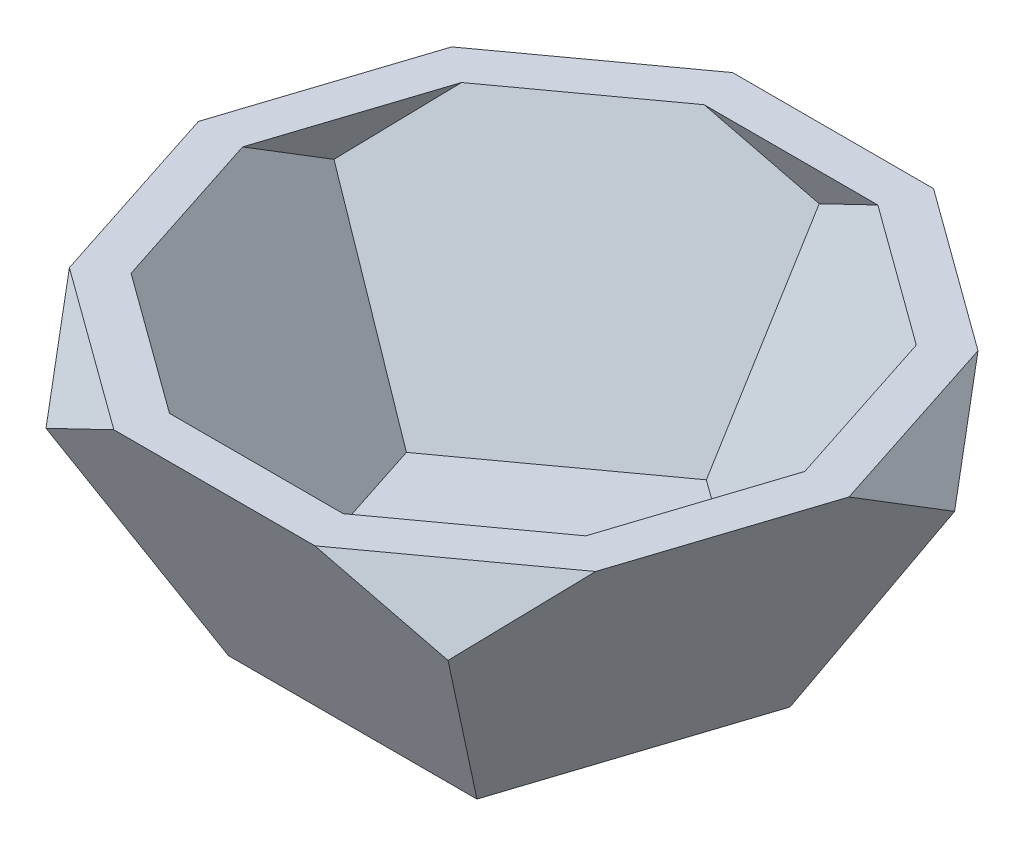
ISO-10303-21;
HEADER;
FILE_DESCRIPTION(('STEP AP214'),'2;1');
FILE_NAME('part.step','',(''),(''),'','','');
FILE_SCHEMA(('AUTOMOTIVE_DESIGN { 1 0 10303 214 1 1 1 1 }'));
ENDSEC;
DATA;
#1=APPLICATION_CONTEXT('core data for automotive mechanical design processes');
#2=APPLICATION_PROTOCOL_DEFINITION('international standard','automotive_design',2000,#1);
#3=PRODUCT_CONTEXT('',#1,'mechanical');
#4=PRODUCT('Part','Part','',(#3));
#5=PRODUCT_RELATED_PRODUCT_CATEGORY('part','',(#4));
#6=PRODUCT_DEFINITION_FORMATION('','',#4);
#7=PRODUCT_DEFINITION_CONTEXT('part definition',#1,'design');
#8=PRODUCT_DEFINITION('design','',#6,#7);
#9=PRODUCT_DEFINITION_SHAPE('','',#8);
#10=(LENGTH_UNIT() NAMED_UNIT(*) SI_UNIT(.MILLI.,.METRE.));
#11=(NAMED_UNIT(*) PLANE_ANGLE_UNIT() SI_UNIT($,.RADIAN.));
#12=(NAMED_UNIT(*) SI_UNIT($,.STERADIAN.) SOLID_ANGLE_UNIT());
#13=UNCERTAINTY_MEASURE_WITH_UNIT(LENGTH_MEASURE(1.E-05),#10,'distance_accuracy_value','');
#14=(GEOMETRIC_REPRESENTATION_CONTEXT(3) GLOBAL_UNCERTAINTY_ASSIGNED_CONTEXT((#13)) GLOBAL_UNIT_ASSIGNED_CONTEXT((#10,
#11,#12)) REPRESENTATION_CONTEXT('',''));
#15=CARTESIAN_POINT('',(0.,0.,0.));
#16=DIRECTION('',(0.,0.,1.));
#17=DIRECTION('',(1.,0.,0.));
#18=AXIS2_PLACEMENT_3D('',#15,#16,#17);
#19=CARTESIAN_POINT('',(8.39798179212871,0.,11.558830307132));
#20=DIRECTION('',(0.850650808330349,-0.447213595545573,0.276393202242972));
#21=DIRECTION('',(0.465341127241469,0.88513142261341,0.));
#22=AXIS2_PLACEMENT_3D('',#19,#20,#21);
#23=PLANE('',#22);
#24=DIRECTION('',(-0.309016994374947,0.,0.951056516295154));
#25=VECTOR('',#24,1.);
#26=CARTESIAN_POINT('',(17.2914717679257,18.7023375,14.4485003685184));
#27=LINE('',#26,#25);
#28=CARTESIAN_POINT('',(17.787107601604,18.7023375,12.9230901227727));
#29=VERTEX_POINT('',#28);
#30=CARTESIAN_POINT('',(21.9860741186857,18.7023375,0.));
#31=VERTEX_POINT('',#30);
#32=EDGE_CURVE('E311',#29,#31,#27,.F.);
#33=ORIENTED_EDGE('',*,*,#32,.F.);
#34=DIRECTION('',(0.50000000001762,0.525731112070631,-0.688190960259838));
#35=VECTOR('',#34,1.);
#36=CARTESIAN_POINT('',(10.9930614391002,11.5586546113071,22.2742924276894));
#37=LINE('',#36,#35);
#38=CARTESIAN_POINT('',(13.5881410845222,14.2872828270101,18.7024717215479));
#39=VERTEX_POINT('',#38);
#40=EDGE_CURVE('E349',#39,#29,#37,.T.);
#41=ORIENTED_EDGE('',*,*,#40,.F.);
#42=DIRECTION('',(-0.309016994403458,-0.850650808322063,-0.42532540421526));
#43=VECTOR('',#42,1.);
#44=CARTESIAN_POINT('',(8.39798179212871,0.,11.558830307132));
#45=LINE('',#44,#43);
#46=CARTESIAN_POINT('',(8.39798179212871,0.,11.558830307132));
#47=VERTEX_POINT('',#46);
#48=EDGE_CURVE('E380',#39,#47,#45,.T.);
#49=ORIENTED_EDGE('',*,*,#48,.T.);
#50=DIRECTION('',(0.309016994374947,0.,-0.951056516295154));
#51=VECTOR('',#50,1.);
#52=CARTESIAN_POINT('',(8.39798179212871,0.,11.558830307132));
#53=LINE('',#52,#51);
#54=CARTESIAN_POINT('',(13.588219976567,0.,-4.41508030713206));
#55=VERTEX_POINT('',#54);
#56=EDGE_CURVE('E360',#47,#55,#53,.T.);
#57=ORIENTED_EDGE('',*,*,#56,.T.);
#58=DIRECTION('',(-0.50000000004613,-0.850650808322063,0.162459848131442));
#59=VECTOR('',#58,1.);
#60=CARTESIAN_POINT('',(13.588219976567,0.,-4.41508030713206));
#61=LINE('',#60,#59);
#62=CARTESIAN_POINT('',(21.9860741186857,14.2872828270101,-7.14370852399755));
#63=VERTEX_POINT('',#62);
#64=EDGE_CURVE('E51',#63,#55,#61,.T.);
#65=ORIENTED_EDGE('',*,*,#64,.F.);
#66=DIRECTION('',(0.,-0.525731112070629,-0.850650808382017));
#67=VECTOR('',#66,1.);
#68=CARTESIAN_POINT('',(21.9860741186857,18.7024046108998,0.000108587716949075));
#69=LINE('',#68,#67);
#70=EDGE_CURVE('E357',#31,#63,#69,.T.);
#71=ORIENTED_EDGE('',*,*,#70,.F.);
#72=EDGE_LOOP('',(#33,#41,#49,#57,#65,#71));
#73=FACE_BOUND('',#72,.T.);
#74=ADVANCED_FACE('F42',(#73),#23,.T.);
#75=CARTESIAN_POINT('',(13.588219976567,0.,-4.41508030713206));
#76=DIRECTION('',(0.525731112105727,-0.447213595545573,-0.723606797731527));
#77=DIRECTION('',(-0.809016994374948,0.,-0.587785252292473));
#78=AXIS2_PLACEMENT_3D('',#75,#76,#77);
#79=PLANE('',#78);
#80=DIRECTION('',(0.809016994374948,0.,0.587785252292473));
#81=VECTOR('',#80,1.);
#82=CARTESIAN_POINT('',(19.084699060216,18.7023375,-11.9803347441146));
#83=LINE('',#82,#81);
#84=CARTESIAN_POINT('',(17.787107601604,18.7023375,-12.9230901227727));
#85=VERTEX_POINT('',#84);
#86=CARTESIAN_POINT('',(6.79407054226109,18.7023375,-20.9099990583243));
#87=VERTEX_POINT('',#86);
#88=EDGE_CURVE('E66',#85,#87,#83,.F.);
#89=ORIENTED_EDGE('',*,*,#88,.F.);
#90=DIRECTION('',(-0.50000000001762,0.525731112070631,-0.688190960259838));
#91=VECTOR('',#90,1.);
#92=CARTESIAN_POINT('',(24.5811537641077,11.5586546113072,-3.57188781785601));
#93=LINE('',#92,#91);
#94=EDGE_CURVE('E353',#63,#85,#93,.T.);
#95=ORIENTED_EDGE('',*,*,#94,.F.);
#96=ORIENTED_EDGE('',*,*,#64,.T.);
#97=DIRECTION('',(-0.809016994374948,0.,-0.587785252292473));
#98=VECTOR('',#97,1.);
#99=CARTESIAN_POINT('',(13.588219976567,0.,-4.41508030713206));
#100=LINE('',#99,#98);
#101=CARTESIAN_POINT('',(0.,0.,-14.2875));
#102=VERTEX_POINT('',#101);
#103=EDGE_CURVE('E364',#55,#102,#100,.T.);
#104=ORIENTED_EDGE('',*,*,#103,.T.);
#105=DIRECTION('',(0.,-0.850650808322063,0.525731112167637));
#106=VECTOR('',#105,1.);
#107=CARTESIAN_POINT('',(0.,0.,-14.2875));
#108=LINE('',#107,#106);
#109=CARTESIAN_POINT('',(0.,14.2872828270101,-23.1175263951007));
#110=VERTEX_POINT('',#109);
#111=EDGE_CURVE('E383',#110,#102,#108,.T.);
#112=ORIENTED_EDGE('',*,*,#111,.F.);
#113=DIRECTION('',(-0.809016994403457,-0.52573111207063,-0.26286555606883));
#114=VECTOR('',#113,1.);
#115=CARTESIAN_POINT('',(6.79417381531687,18.7024046108998,-20.9099655028744));
#116=LINE('',#115,#114);
#117=EDGE_CURVE('E329',#87,#110,#116,.T.);
#118=ORIENTED_EDGE('',*,*,#117,.F.);
#119=EDGE_LOOP('',(#89,#95,#96,#104,#112,#118));
#120=FACE_BOUND('',#119,.T.);
#121=ADVANCED_FACE('F44',(#120),#79,.T.);
#122=CARTESIAN_POINT('',(0.,0.,-14.2875));
#123=DIRECTION('',(-0.525731112105728,-0.447213595545573,-0.723606797731527));
#124=DIRECTION('',(-0.809016994374947,0.,0.587785252292474));
#125=AXIS2_PLACEMENT_3D('',#122,#123,#124);
#126=PLANE('',#125);
#127=DIRECTION('',(0.809016994374947,0.,-0.587785252292474));
#128=VECTOR('',#127,1.);
#129=CARTESIAN_POINT('',(-5.49647908364905,18.7023375,-21.8527544369825));
#130=LINE('',#129,#128);
#131=CARTESIAN_POINT('',(-6.7940705422611,18.7023375,-20.9099990583243));
#132=VERTEX_POINT('',#131);
#133=CARTESIAN_POINT('',(-17.787107601604,18.7023375,-12.9230901227727));
#134=VERTEX_POINT('',#133);
#135=EDGE_CURVE('E279',#132,#134,#130,.F.);
#136=ORIENTED_EDGE('',*,*,#135,.F.);
#137=DIRECTION('',(-0.809016994403457,0.52573111207063,0.26286555606883));
#138=VECTOR('',#137,1.);
#139=CARTESIAN_POINT('',(4.19892706980575,11.5586546113072,-24.4818405031261));
#140=LINE('',#139,#138);
#141=EDGE_CURVE('E325',#110,#132,#140,.T.);
#142=ORIENTED_EDGE('',*,*,#141,.F.);
#143=ORIENTED_EDGE('',*,*,#111,.T.);
#144=DIRECTION('',(-0.809016994374947,0.,0.587785252292474));
#145=VECTOR('',#144,1.);
#146=CARTESIAN_POINT('',(0.,0.,-14.2875));
#147=LINE('',#146,#145);
#148=CARTESIAN_POINT('',(-13.588219976567,0.,-4.41508030713204));
#149=VERTEX_POINT('',#148);
#150=EDGE_CURVE('E368',#102,#149,#147,.T.);
#151=ORIENTED_EDGE('',*,*,#150,.T.);
#152=DIRECTION('',(0.50000000004613,-0.850650808322063,0.162459848131441));
#153=VECTOR('',#152,1.);
#154=CARTESIAN_POINT('',(-13.588219976567,0.,-4.41508030713204));
#155=LINE('',#154,#153);
#156=CARTESIAN_POINT('',(-21.9860741186858,14.2872828270101,-7.14370852399752));
#157=VERTEX_POINT('',#156);
#158=EDGE_CURVE('E389',#157,#149,#155,.T.);
#159=ORIENTED_EDGE('',*,*,#158,.F.);
#160=DIRECTION('',(-0.50000000001762,-0.52573111207063,0.688190960259839));
#161=VECTOR('',#160,1.);
#162=CARTESIAN_POINT('',(-17.7870437753454,18.7024046108998,-12.9231779720811));
#163=LINE('',#162,#161);
#164=EDGE_CURVE('E336',#134,#157,#163,.T.);
#165=ORIENTED_EDGE('',*,*,#164,.F.);
#166=EDGE_LOOP('',(#136,#142,#143,#151,#159,#165));
#167=FACE_BOUND('',#166,.T.);
#168=ADVANCED_FACE('F396',(#167),#126,.T.);
#169=CARTESIAN_POINT('',(-13.588219976567,0.,-4.41508030713204));
#170=DIRECTION('',(-0.850650808330348,-0.447213595545573,0.276393202242974));
#171=DIRECTION('',(0.46534112724147,-0.88513142261341,0.));
#172=AXIS2_PLACEMENT_3D('',#169,#170,#171);
#173=PLANE('',#172);
#174=DIRECTION('',(-0.309016994374949,0.,-0.951056516295153));
#175=VECTOR('',#174,1.);
#176=CARTESIAN_POINT('',(-22.481709952364,18.7023375,-1.52541024574567));
#177=LINE('',#176,#175);
#178=CARTESIAN_POINT('',(-21.9860741186858,18.7023375,0.));
#179=VERTEX_POINT('',#178);
#180=CARTESIAN_POINT('',(-17.787107601604,18.7023375,12.9230901227727));
#181=VERTEX_POINT('',#180);
#182=EDGE_CURVE('E308',#179,#181,#177,.F.);
#183=ORIENTED_EDGE('',*,*,#182,.F.);
#184=DIRECTION('',(0.,0.525731112070631,0.850650808382016));
#185=VECTOR('',#184,1.);
#186=CARTESIAN_POINT('',(-21.9860741186858,11.5586546113071,-11.5587217202298));
#187=LINE('',#186,#185);
#188=EDGE_CURVE('E332',#157,#179,#187,.T.);
#189=ORIENTED_EDGE('',*,*,#188,.F.);
#190=ORIENTED_EDGE('',*,*,#158,.T.);
#191=DIRECTION('',(0.309016994374949,0.,0.951056516295153));
#192=VECTOR('',#191,1.);
#193=CARTESIAN_POINT('',(-13.588219976567,0.,-4.41508030713204));
#194=LINE('',#193,#192);
#195=CARTESIAN_POINT('',(-8.39798179212869,0.,11.5588303071321));
#196=VERTEX_POINT('',#195);
#197=EDGE_CURVE('E372',#149,#196,#194,.T.);
#198=ORIENTED_EDGE('',*,*,#197,.T.);
#199=DIRECTION('',(0.309016994403457,-0.850650808322063,-0.425325404215261));
#200=VECTOR('',#199,1.);
#201=CARTESIAN_POINT('',(-8.39798179212869,0.,11.5588303071321));
#202=LINE('',#201,#200);
#203=CARTESIAN_POINT('',(-13.5881410845222,14.2872828270101,18.7024717215479));
#204=VERTEX_POINT('',#203);
#205=EDGE_CURVE('E386',#204,#196,#202,.T.);
#206=ORIENTED_EDGE('',*,*,#205,.F.);
#207=DIRECTION('',(0.500000000017621,-0.525731112070629,0.688190960259839));
#208=VECTOR('',#207,1.);
#209=CARTESIAN_POINT('',(-17.7871714278626,18.7024046108998,12.9230022734643));
#210=LINE('',#209,#208);
#211=EDGE_CURVE('E343',#181,#204,#210,.T.);
#212=ORIENTED_EDGE('',*,*,#211,.F.);
#213=EDGE_LOOP('',(#183,#189,#190,#198,#206,#212));
#214=FACE_BOUND('',#213,.T.);
#215=ADVANCED_FACE('F412',(#214),#173,.T.);
#216=CARTESIAN_POINT('',(-8.39798179212869,0.,11.5588303071321));
#217=DIRECTION('',(0.,-0.447213595545573,0.894427190977108));
#218=DIRECTION('',(0.,-0.894427190977108,-0.447213595545573));
#219=AXIS2_PLACEMENT_3D('',#216,#217,#218);
#220=PLANE('',#219);
#221=DIRECTION('',(-1.,0.,0.));
#222=VECTOR('',#221,1.);
#223=CARTESIAN_POINT('',(-8.39798179212868,18.7023375,20.9099990583243));
#224=LINE('',#223,#222);
#225=CARTESIAN_POINT('',(-6.79407054226109,18.7023375,20.9099990583243));
#226=VERTEX_POINT('',#225);
#227=CARTESIAN_POINT('',(6.79407054226109,18.7023375,20.9099990583243));
#228=VERTEX_POINT('',#227);
#229=EDGE_CURVE('E322',#226,#228,#224,.F.);
#230=ORIENTED_EDGE('',*,*,#229,.F.);
#231=DIRECTION('',(0.809016994403457,0.525731112070631,0.26286555606883));
#232=VECTOR('',#231,1.);
#233=CARTESIAN_POINT('',(-17.7870681543279,11.5586546113072,17.3381576135225));
#234=LINE('',#233,#232);
#235=EDGE_CURVE('E339',#204,#226,#234,.T.);
#236=ORIENTED_EDGE('',*,*,#235,.F.);
#237=ORIENTED_EDGE('',*,*,#205,.T.);
#238=DIRECTION('',(1.,0.,0.));
#239=VECTOR('',#238,1.);
#240=CARTESIAN_POINT('',(-8.39798179212869,0.,11.5588303071321));
#241=LINE('',#240,#239);
#242=EDGE_CURVE('E376',#196,#47,#241,.T.);
#243=ORIENTED_EDGE('',*,*,#242,.T.);
#244=ORIENTED_EDGE('',*,*,#48,.F.);
#245=DIRECTION('',(0.809016994403458,-0.525731112070629,-0.26286555606883));
#246=VECTOR('',#245,1.);
#247=CARTESIAN_POINT('',(6.7939672692053,18.7024046108998,20.9100326137742));
#248=LINE('',#247,#246);
#249=EDGE_CURVE('E346',#228,#39,#248,.T.);
#250=ORIENTED_EDGE('',*,*,#249,.F.);
#251=EDGE_LOOP('',(#230,#236,#237,#243,#244,#250));
#252=FACE_BOUND('',#251,.T.);
#253=ADVANCED_FACE('F424',(#252),#220,.T.);
#254=CARTESIAN_POINT('',(13.588219976567,37.404675,4.41508030713206));
#255=DIRECTION('',(-0.850650808330349,-0.447213595545573,0.276393202242973));
#256=DIRECTION('',(0.465341127241469,-0.88513142261341,0.));
#257=AXIS2_PLACEMENT_3D('',#254,#255,#256);
#258=PLANE('',#257);
#259=ORIENTED_EDGE('',*,*,#94,.T.);
#260=DIRECTION('',(-0.309016994374947,0.,-0.951056516295154));
#261=VECTOR('',#260,1.);
#262=CARTESIAN_POINT('',(22.481709952364,18.7023375,1.5254102457457));
#263=LINE('',#262,#261);
#264=EDGE_CURVE('E304',#85,#31,#263,.F.);
#265=ORIENTED_EDGE('',*,*,#264,.T.);
#266=ORIENTED_EDGE('',*,*,#70,.T.);
#267=EDGE_LOOP('',(#259,#265,#266));
#268=FACE_BOUND('',#267,.T.);
#269=ADVANCED_FACE('F434',(#268),#258,.F.);
#270=CARTESIAN_POINT('',(0.,37.404675,14.2875));
#271=DIRECTION('',(-0.525731112105727,-0.447213595545573,-0.723606797731527));
#272=DIRECTION('',(-0.809016994374948,0.,0.587785252292473));
#273=AXIS2_PLACEMENT_3D('',#270,#271,#272);
#274=PLANE('',#273);
#275=ORIENTED_EDGE('',*,*,#40,.T.);
#276=DIRECTION('',(0.809016994374948,0.,-0.587785252292473));
#277=VECTOR('',#276,1.);
#278=CARTESIAN_POINT('',(5.49647908364902,18.7023375,21.8527544369825));
#279=LINE('',#278,#277);
#280=EDGE_CURVE('E318',#29,#228,#279,.F.);
#281=ORIENTED_EDGE('',*,*,#280,.T.);
#282=ORIENTED_EDGE('',*,*,#249,.T.);
#283=EDGE_LOOP('',(#275,#281,#282));
#284=FACE_BOUND('',#283,.T.);
#285=ADVANCED_FACE('F429',(#284),#274,.F.);
#286=CARTESIAN_POINT('',(-13.588219976567,37.404675,4.41508030713206));
#287=DIRECTION('',(0.525731112105727,-0.447213595545573,-0.723606797731527));
#288=DIRECTION('',(-0.809016994374947,0.,-0.587785252292473));
#289=AXIS2_PLACEMENT_3D('',#286,#287,#288);
#290=PLANE('',#289);
#291=ORIENTED_EDGE('',*,*,#235,.T.);
#292=DIRECTION('',(0.809016994374947,0.,0.587785252292473));
#293=VECTOR('',#292,1.);
#294=CARTESIAN_POINT('',(-19.084699060216,18.7023375,11.9803347441146));
#295=LINE('',#294,#293);
#296=EDGE_CURVE('E314',#226,#181,#295,.F.);
#297=ORIENTED_EDGE('',*,*,#296,.T.);
#298=ORIENTED_EDGE('',*,*,#211,.T.);
#299=EDGE_LOOP('',(#291,#297,#298));
#300=FACE_BOUND('',#299,.T.);
#301=ADVANCED_FACE('F421',(#300),#290,.F.);
#302=CARTESIAN_POINT('',(-8.3979817921287,37.404675,-11.558830307132));
#303=DIRECTION('',(0.850650808330348,-0.447213595545573,0.276393202242973));
#304=DIRECTION('',(0.465341127241469,0.88513142261341,0.));
#305=AXIS2_PLACEMENT_3D('',#302,#303,#304);
#306=PLANE('',#305);
#307=ORIENTED_EDGE('',*,*,#188,.T.);
#308=DIRECTION('',(-0.309016994374947,0.,0.951056516295154));
#309=VECTOR('',#308,1.);
#310=CARTESIAN_POINT('',(-17.2914717679257,18.7023375,-14.4485003685184));
#311=LINE('',#310,#309);
#312=EDGE_CURVE('E300',#179,#134,#311,.F.);
#313=ORIENTED_EDGE('',*,*,#312,.T.);
#314=ORIENTED_EDGE('',*,*,#164,.T.);
#315=EDGE_LOOP('',(#307,#313,#314));
#316=FACE_BOUND('',#315,.T.);
#317=ADVANCED_FACE('F417',(#316),#306,.F.);
#318=CARTESIAN_POINT('',(8.3979817921287,37.404675,-11.558830307132));
#319=DIRECTION('',(0.,-0.447213595545573,0.894427190977108));
#320=DIRECTION('',(0.,-0.894427190977108,-0.447213595545573));
#321=AXIS2_PLACEMENT_3D('',#318,#319,#320);
#322=PLANE('',#321);
#323=ORIENTED_EDGE('',*,*,#141,.T.);
#324=DIRECTION('',(-1.,0.,0.));
#325=VECTOR('',#324,1.);
#326=CARTESIAN_POINT('',(8.3979817921287,18.7023375,-20.9099990583243));
#327=LINE('',#326,#325);
#328=EDGE_CURVE('E12',#132,#87,#327,.F.);
#329=ORIENTED_EDGE('',*,*,#328,.T.);
#330=ORIENTED_EDGE('',*,*,#117,.T.);
#331=EDGE_LOOP('',(#323,#329,#330));
#332=FACE_BOUND('',#331,.T.);
#333=ADVANCED_FACE('F436',(#332),#322,.F.);
#334=CARTESIAN_POINT('',(0.,0.,0.));
#335=DIRECTION('',(0.,1.,0.));
#336=DIRECTION('',(0.,0.,1.));
#337=AXIS2_PLACEMENT_3D('',#334,#335,#336);
#338=PLANE('',#337);
#339=ORIENTED_EDGE('',*,*,#56,.F.);
#340=ORIENTED_EDGE('',*,*,#242,.F.);
#341=ORIENTED_EDGE('',*,*,#197,.F.);
#342=ORIENTED_EDGE('',*,*,#150,.F.);
#343=ORIENTED_EDGE('',*,*,#103,.F.);
#344=EDGE_LOOP('',(#339,#340,#341,#342,#343));
#345=FACE_BOUND('',#344,.T.);
#346=ADVANCED_FACE('F407',(#345),#338,.F.);
#347=CARTESIAN_POINT('',(0.,18.7023375,0.));
#348=DIRECTION('',(0.,1.,0.));
#349=DIRECTION('',(0.,0.,1.));
#350=AXIS2_PLACEMENT_3D('',#347,#348,#349);
#351=PLANE('',#350);
#352=DIRECTION('',(-1.,0.,0.));
#353=VECTOR('',#352,1.);
#354=CARTESIAN_POINT('',(-8.39798179212868,18.7023375,18.0701927268272));
#355=LINE('',#354,#353);
#356=CARTESIAN_POINT('',(-5.87136153167075,18.7023375,18.0701927268272));
#357=VERTEX_POINT('',#356);
#358=CARTESIAN_POINT('',(5.87136153167075,18.7023375,18.0701927268272));
#359=VERTEX_POINT('',#358);
#360=EDGE_CURVE('E239',#357,#359,#355,.F.);
#361=ORIENTED_EDGE('',*,*,#360,.F.);
#362=DIRECTION('',(0.809016994374947,0.,0.587785252292473));
#363=VECTOR('',#362,1.);
#364=CARTESIAN_POINT('',(-17.4155027791952,18.7023375,9.68288316119979));
#365=LINE('',#364,#363);
#366=CARTESIAN_POINT('',(-15.3714240501527,18.7023375,11.1679932884403));
#367=VERTEX_POINT('',#366);
#368=EDGE_CURVE('E265',#357,#367,#365,.F.);
#369=ORIENTED_EDGE('',*,*,#368,.T.);
#370=DIRECTION('',(-0.309016994374949,0.,-0.951056516295153));
#371=VECTOR('',#370,1.);
#372=CARTESIAN_POINT('',(-19.7808936357774,18.7023375,-2.40295866291187));
#373=LINE('',#372,#371);
#374=CARTESIAN_POINT('',(-19.0001250369639,18.7023375,0.));
#375=VERTEX_POINT('',#374);
#376=EDGE_CURVE('E266',#375,#367,#373,.F.);
#377=ORIENTED_EDGE('',*,*,#376,.F.);
#378=DIRECTION('',(-0.309016994374947,0.,0.951056516295154));
#379=VECTOR('',#378,1.);
#380=CARTESIAN_POINT('',(-14.5906554513391,18.7023375,-13.5709519513522));
#381=LINE('',#380,#379);
#382=CARTESIAN_POINT('',(-15.3714240501527,18.7023375,-11.1679932884403));
#383=VERTEX_POINT('',#382);
#384=EDGE_CURVE('E271',#375,#383,#381,.F.);
#385=ORIENTED_EDGE('',*,*,#384,.T.);
#386=DIRECTION('',(0.809016994374947,0.,-0.587785252292474));
#387=VECTOR('',#386,1.);
#388=CARTESIAN_POINT('',(-3.82728280262824,18.7023375,-19.5553028540677));
#389=LINE('',#388,#387);
#390=CARTESIAN_POINT('',(-5.87136153167077,18.7023375,-18.0701927268272));
#391=VERTEX_POINT('',#390);
#392=EDGE_CURVE('E275',#391,#383,#389,.F.);
#393=ORIENTED_EDGE('',*,*,#392,.F.);
#394=DIRECTION('',(-1.,0.,0.));
#395=VECTOR('',#394,1.);
#396=CARTESIAN_POINT('',(8.3979817921287,18.7023375,-18.0701927268272));
#397=LINE('',#396,#395);
#398=CARTESIAN_POINT('',(5.87136153167074,18.7023375,-18.0701927268272));
#399=VERTEX_POINT('',#398);
#400=EDGE_CURVE('E221',#391,#399,#397,.F.);
#401=ORIENTED_EDGE('',*,*,#400,.T.);
#402=DIRECTION('',(0.809016994374948,0.,0.587785252292473));
#403=VECTOR('',#402,1.);
#404=CARTESIAN_POINT('',(17.4155027791952,18.7023375,-9.68288316119979));
#405=LINE('',#404,#403);
#406=CARTESIAN_POINT('',(15.3714240501527,18.7023375,-11.1679932884403));
#407=VERTEX_POINT('',#406);
#408=EDGE_CURVE('E272',#407,#399,#405,.F.);
#409=ORIENTED_EDGE('',*,*,#408,.F.);
#410=DIRECTION('',(-0.309016994374947,0.,-0.951056516295154));
#411=VECTOR('',#410,1.);
#412=CARTESIAN_POINT('',(19.7808936357774,18.7023375,2.40295866291189));
#413=LINE('',#412,#411);
#414=CARTESIAN_POINT('',(19.0001250369638,18.7023375,0.));
#415=VERTEX_POINT('',#414);
#416=EDGE_CURVE('E267',#407,#415,#413,.F.);
#417=ORIENTED_EDGE('',*,*,#416,.T.);
#418=DIRECTION('',(-0.309016994374947,0.,0.951056516295154));
#419=VECTOR('',#418,1.);
#420=CARTESIAN_POINT('',(14.5906554513391,18.7023375,13.5709519513522));
#421=LINE('',#420,#419);
#422=CARTESIAN_POINT('',(15.3714240501527,18.7023375,11.1679932884403));
#423=VERTEX_POINT('',#422);
#424=EDGE_CURVE('E262',#423,#415,#421,.F.);
#425=ORIENTED_EDGE('',*,*,#424,.F.);
#426=DIRECTION('',(0.809016994374948,0.,-0.587785252292473));
#427=VECTOR('',#426,1.);
#428=CARTESIAN_POINT('',(3.82728280262821,18.7023375,19.5553028540677));
#429=LINE('',#428,#427);
#430=EDGE_CURVE('E290',#423,#359,#429,.F.);
#431=ORIENTED_EDGE('',*,*,#430,.T.);
#432=EDGE_LOOP('',(#361,#369,#377,#385,#393,#401,#409,#417,#425,#431));
#433=FACE_BOUND('',#432,.T.);
#434=ORIENTED_EDGE('',*,*,#229,.T.);
#435=ORIENTED_EDGE('',*,*,#280,.F.);
#436=ORIENTED_EDGE('',*,*,#32,.T.);
#437=ORIENTED_EDGE('',*,*,#264,.F.);
#438=ORIENTED_EDGE('',*,*,#88,.T.);
#439=ORIENTED_EDGE('',*,*,#328,.F.);
#440=ORIENTED_EDGE('',*,*,#135,.T.);
#441=ORIENTED_EDGE('',*,*,#312,.F.);
#442=ORIENTED_EDGE('',*,*,#182,.T.);
#443=ORIENTED_EDGE('',*,*,#296,.F.);
#444=EDGE_LOOP('',(#434,#435,#436,#437,#438,#439,#440,#441,#442,#443));
#445=FACE_BOUND('',#444,.T.);
#446=ADVANCED_FACE('F418',(#433,#445),#351,.T.);
#447=CARTESIAN_POINT('',(6.23732873896962,1.13592253268576,10.8567915734349));
#448=DIRECTION('',(0.850650808330349,-0.447213595545573,0.276393202242972));
#449=DIRECTION('',(0.465341127241469,0.88513142261341,0.));
#450=AXIS2_PLACEMENT_3D('',#447,#448,#449);
#451=PLANE('',#450);
#452=ORIENTED_EDGE('',*,*,#424,.T.);
#453=DIRECTION('',(0.,-0.525731112070629,-0.850650808382017));
#454=VECTOR('',#453,1.);
#455=CARTESIAN_POINT('',(19.0001250369638,18.7024046108998,0.000108587716948425));
#456=LINE('',#455,#454);
#457=CARTESIAN_POINT('',(19.0001250369638,14.8868954897984,-6.17351485539754));
#458=VERTEX_POINT('',#457);
#459=EDGE_CURVE('E210',#415,#458,#456,.T.);
#460=ORIENTED_EDGE('',*,*,#459,.T.);
#461=DIRECTION('',(-0.50000000004613,-0.850650808322063,0.162459848131442));
#462=VECTOR('',#461,1.);
#463=CARTESIAN_POINT('',(11.1725364252859,1.56980633155427,-3.630177141455));
#464=LINE('',#463,#462);
#465=CARTESIAN_POINT('',(11.7428019555386,2.54,-3.81546764431678));
#466=VERTEX_POINT('',#465);
#467=EDGE_CURVE('E206',#458,#466,#464,.T.);
#468=ORIENTED_EDGE('',*,*,#467,.T.);
#469=DIRECTION('',(-0.309016994374947,0.,0.951056516295154));
#470=VECTOR('',#469,1.);
#471=CARTESIAN_POINT('',(6.90500725139096,2.54,11.0737334728721));
#472=LINE('',#471,#470);
#473=CARTESIAN_POINT('',(7.25745073168159,2.54,9.98902397579682));
#474=VERTEX_POINT('',#473);
#475=EDGE_CURVE('E198',#474,#466,#472,.F.);
#476=ORIENTED_EDGE('',*,*,#475,.F.);
#477=DIRECTION('',(-0.309016994403458,-0.850650808322063,-0.42532540421526));
#478=VECTOR('',#477,1.);
#479=CARTESIAN_POINT('',(6.90500725137298,1.56980633155427,9.5039271415121));
#480=LINE('',#479,#478);
#481=CARTESIAN_POINT('',(11.7427230633415,14.8868954897984,16.1624717214831));
#482=VERTEX_POINT('',#481);
#483=EDGE_CURVE('E179',#482,#474,#480,.T.);
#484=ORIENTED_EDGE('',*,*,#483,.F.);
#485=DIRECTION('',(0.50000000001762,0.525731112070631,-0.688190960259838));
#486=VECTOR('',#485,1.);
#487=CARTESIAN_POINT('',(8.57737788764894,11.5586546113071,20.519195593357));
#488=LINE('',#487,#486);
#489=EDGE_CURVE('E226',#482,#423,#488,.T.);
#490=ORIENTED_EDGE('',*,*,#489,.T.);
#491=EDGE_LOOP('',(#452,#460,#468,#476,#484,#490));
#492=FACE_BOUND('',#491,.T.);
#493=ADVANCED_FACE('F204',(#492),#451,.F.);
#494=CARTESIAN_POINT('',(12.2528629518184,1.13592253268576,-2.57711904089398));
#495=DIRECTION('',(0.525731112105727,-0.447213595545573,-0.723606797731527));
#496=DIRECTION('',(-0.809016994374948,0.,-0.587785252292473));
#497=AXIS2_PLACEMENT_3D('',#494,#495,#496);
#498=PLANE('',#497);
#499=ORIENTED_EDGE('',*,*,#408,.T.);
#500=DIRECTION('',(-0.809016994403457,-0.52573111207063,-0.26286555606883));
#501=VECTOR('',#500,1.);
#502=CARTESIAN_POINT('',(5.87146480472653,18.7024046108998,-18.0701591713773));
#503=LINE('',#502,#501);
#504=CARTESIAN_POINT('',(0.,14.8868954897984,-19.9779137321712));
#505=VERTEX_POINT('',#504);
#506=EDGE_CURVE('E231',#399,#505,#503,.T.);
#507=ORIENTED_EDGE('',*,*,#506,.T.);
#508=DIRECTION('',(0.,-0.850650808322063,0.525731112167637));
#509=VECTOR('',#508,1.);
#510=CARTESIAN_POINT('',(0.,1.56980633155427,-11.7475000001142));
#511=LINE('',#510,#509);
#512=CARTESIAN_POINT('',(0.,2.54,-12.3471126629601));
#513=VERTEX_POINT('',#512);
#514=EDGE_CURVE('E222',#505,#513,#511,.T.);
#515=ORIENTED_EDGE('',*,*,#514,.T.);
#516=DIRECTION('',(0.809016994374948,0.,0.587785252292473));
#517=VECTOR('',#516,1.);
#518=CARTESIAN_POINT('',(12.6655109660528,2.54,-3.14508030720447));
#519=LINE('',#518,#517);
#520=EDGE_CURVE('E209',#466,#513,#519,.F.);
#521=ORIENTED_EDGE('',*,*,#520,.F.);
#522=ORIENTED_EDGE('',*,*,#467,.F.);
#523=DIRECTION('',(-0.50000000001762,0.525731112070631,-0.688190960259838));
#524=VECTOR('',#523,1.);
#525=CARTESIAN_POINT('',(22.1654702126564,11.5586546113072,-1.81679098352362));
#526=LINE('',#525,#524);
#527=EDGE_CURVE('E216',#458,#407,#526,.T.);
#528=ORIENTED_EDGE('',*,*,#527,.T.);
#529=EDGE_LOOP('',(#499,#507,#515,#521,#522,#528));
#530=FACE_BOUND('',#529,.T.);
#531=ADVANCED_FACE('F513',(#530),#498,.F.);
#532=CARTESIAN_POINT('',(1.33535702474854,1.13592253268576,-12.4495387337619));
#533=DIRECTION('',(-0.525731112105728,-0.447213595545573,-0.723606797731527));
#534=DIRECTION('',(-0.809016994374947,0.,0.587785252292474));
#535=AXIS2_PLACEMENT_3D('',#532,#533,#534);
#536=PLANE('',#535);
#537=ORIENTED_EDGE('',*,*,#392,.T.);
#538=DIRECTION('',(-0.50000000001762,-0.52573111207063,0.688190960259839));
#539=VECTOR('',#538,1.);
#540=CARTESIAN_POINT('',(-15.3713602238941,18.7024046108998,-11.1680811377487));
#541=LINE('',#540,#539);
#542=CARTESIAN_POINT('',(-19.0001250369639,14.8868954897984,-6.17351485539752));
#543=VERTEX_POINT('',#542);
#544=EDGE_CURVE('E244',#383,#543,#541,.T.);
#545=ORIENTED_EDGE('',*,*,#544,.T.);
#546=DIRECTION('',(0.50000000004613,-0.850650808322063,0.162459848131441));
#547=VECTOR('',#546,1.);
#548=CARTESIAN_POINT('',(-11.172536425286,1.56980633155427,-3.63017714145498));
#549=LINE('',#548,#547);
#550=CARTESIAN_POINT('',(-11.7428019555386,2.54,-3.81546764431677));
#551=VERTEX_POINT('',#550);
#552=EDGE_CURVE('E230',#543,#551,#549,.T.);
#553=ORIENTED_EDGE('',*,*,#552,.T.);
#554=DIRECTION('',(0.809016994374947,0.,-0.587785252292474));
#555=VECTOR('',#554,1.);
#556=CARTESIAN_POINT('',(0.922709010514185,2.54,-13.0175000000724));
#557=LINE('',#556,#555);
#558=EDGE_CURVE('E214',#513,#551,#557,.F.);
#559=ORIENTED_EDGE('',*,*,#558,.F.);
#560=ORIENTED_EDGE('',*,*,#514,.F.);
#561=DIRECTION('',(-0.809016994403457,0.52573111207063,0.26286555606883));
#562=VECTOR('',#561,1.);
#563=CARTESIAN_POINT('',(5.12163608039609,11.5586546113072,-21.642034171629));
#564=LINE('',#563,#562);
#565=EDGE_CURVE('E235',#505,#391,#564,.T.);
#566=ORIENTED_EDGE('',*,*,#565,.T.);
#567=EDGE_LOOP('',(#537,#545,#553,#559,#560,#566));
#568=FACE_BOUND('',#567,.T.);
#569=ADVANCED_FACE('F522',(#568),#536,.F.);
#570=CARTESIAN_POINT('',(-11.4275669234079,1.13592253268576,-5.1171190408292));
#571=DIRECTION('',(-0.850650808330348,-0.447213595545573,0.276393202242974));
#572=DIRECTION('',(0.46534112724147,-0.88513142261341,0.));
#573=AXIS2_PLACEMENT_3D('',#570,#571,#572);
#574=PLANE('',#573);
#575=ORIENTED_EDGE('',*,*,#376,.T.);
#576=DIRECTION('',(0.500000000017621,-0.525731112070629,0.688190960259839));
#577=VECTOR('',#576,1.);
#578=CARTESIAN_POINT('',(-15.3714878764113,18.7024046108998,11.1679054391319));
#579=LINE('',#578,#577);
#580=CARTESIAN_POINT('',(-11.7427230633415,14.8868954897984,16.1624717214831));
#581=VERTEX_POINT('',#580);
#582=EDGE_CURVE('E58',#367,#581,#579,.T.);
#583=ORIENTED_EDGE('',*,*,#582,.T.);
#584=DIRECTION('',(0.309016994403457,-0.850650808322063,-0.425325404215261));
#585=VECTOR('',#584,1.);
#586=CARTESIAN_POINT('',(-6.90500725137296,1.56980633155427,9.50392714151212));
#587=LINE('',#586,#585);
#588=CARTESIAN_POINT('',(-7.25745073168157,2.54,9.98902397579683));
#589=VERTEX_POINT('',#588);
#590=EDGE_CURVE('E191',#581,#589,#587,.T.);
#591=ORIENTED_EDGE('',*,*,#590,.T.);
#592=DIRECTION('',(-0.309016994374949,0.,-0.951056516295153));
#593=VECTOR('',#592,1.);
#594=CARTESIAN_POINT('',(-12.0952454358292,2.54,-4.90017714139202));
#595=LINE('',#594,#593);
#596=EDGE_CURVE('E201',#551,#589,#595,.F.);
#597=ORIENTED_EDGE('',*,*,#596,.F.);
#598=ORIENTED_EDGE('',*,*,#552,.F.);
#599=DIRECTION('',(0.,0.525731112070631,0.850650808382016));
#600=VECTOR('',#599,1.);
#601=CARTESIAN_POINT('',(-19.0001250369639,11.5586546113071,-11.5587217202298));
#602=LINE('',#601,#600);
#603=EDGE_CURVE('E234',#543,#375,#602,.T.);
#604=ORIENTED_EDGE('',*,*,#603,.T.);
#605=EDGE_LOOP('',(#575,#583,#591,#597,#598,#604));
#606=FACE_BOUND('',#605,.T.);
#607=ADVANCED_FACE('F532',(#606),#574,.F.);
#608=CARTESIAN_POINT('',(-8.39798179212869,1.13592253268576,9.2869852420502));
#609=DIRECTION('',(0.,-0.447213595545573,0.894427190977108));
#610=DIRECTION('',(0.,-0.894427190977108,-0.447213595545573));
#611=AXIS2_PLACEMENT_3D('',#608,#609,#610);
#612=PLANE('',#611);
#613=ORIENTED_EDGE('',*,*,#360,.T.);
#614=DIRECTION('',(0.809016994403458,-0.525731112070629,-0.26286555606883));
#615=VECTOR('',#614,1.);
#616=CARTESIAN_POINT('',(5.87125825861496,18.7024046108998,18.0702262822771));
#617=LINE('',#616,#615);
#618=EDGE_CURVE('E185',#359,#482,#617,.T.);
#619=ORIENTED_EDGE('',*,*,#618,.T.);
#620=ORIENTED_EDGE('',*,*,#483,.T.);
#621=DIRECTION('',(-1.,0.,0.));
#622=VECTOR('',#621,1.);
#623=CARTESIAN_POINT('',(-8.39798179212869,2.54,9.98902397579683));
#624=LINE('',#623,#622);
#625=EDGE_CURVE('E183',#589,#474,#624,.F.);
#626=ORIENTED_EDGE('',*,*,#625,.F.);
#627=ORIENTED_EDGE('',*,*,#590,.F.);
#628=DIRECTION('',(0.809016994403457,0.525731112070631,0.26286555606883));
#629=VECTOR('',#628,1.);
#630=CARTESIAN_POINT('',(-16.8643591437376,11.5586546113072,14.4983512820254));
#631=LINE('',#630,#629);
#632=EDGE_CURVE('E247',#581,#357,#631,.T.);
#633=ORIENTED_EDGE('',*,*,#632,.T.);
#634=EDGE_LOOP('',(#613,#619,#620,#626,#627,#633));
#635=FACE_BOUND('',#634,.T.);
#636=ADVANCED_FACE('F181',(#635),#612,.F.);
#637=CARTESIAN_POINT('',(11.4275669234079,36.2687524673142,5.11711904082921));
#638=DIRECTION('',(-0.850650808330349,-0.447213595545573,0.276393202242973));
#639=DIRECTION('',(0.465341127241469,-0.88513142261341,0.));
#640=AXIS2_PLACEMENT_3D('',#637,#638,#639);
#641=PLANE('',#640);
#642=ORIENTED_EDGE('',*,*,#527,.F.);
#643=ORIENTED_EDGE('',*,*,#459,.F.);
#644=ORIENTED_EDGE('',*,*,#416,.F.);
#645=EDGE_LOOP('',(#642,#643,#644));
#646=FACE_BOUND('',#645,.T.);
#647=ADVANCED_FACE('F551',(#646),#641,.T.);
#648=CARTESIAN_POINT('',(-1.33535702474856,36.2687524673142,12.4495387337619));
#649=DIRECTION('',(-0.525731112105727,-0.447213595545573,-0.723606797731527));
#650=DIRECTION('',(-0.809016994374948,0.,0.587785252292473));
#651=AXIS2_PLACEMENT_3D('',#648,#649,#650);
#652=PLANE('',#651);
#653=ORIENTED_EDGE('',*,*,#489,.F.);
#654=ORIENTED_EDGE('',*,*,#618,.F.);
#655=ORIENTED_EDGE('',*,*,#430,.F.);
#656=EDGE_LOOP('',(#653,#654,#655));
#657=FACE_BOUND('',#656,.T.);
#658=ADVANCED_FACE('F560',(#657),#652,.T.);
#659=CARTESIAN_POINT('',(-12.2528629518184,36.2687524673142,2.57711904089398));
#660=DIRECTION('',(0.525731112105727,-0.447213595545573,-0.723606797731527));
#661=DIRECTION('',(-0.809016994374947,0.,-0.587785252292473));
#662=AXIS2_PLACEMENT_3D('',#659,#660,#661);
#663=PLANE('',#662);
#664=ORIENTED_EDGE('',*,*,#632,.F.);
#665=ORIENTED_EDGE('',*,*,#582,.F.);
#666=ORIENTED_EDGE('',*,*,#368,.F.);
#667=EDGE_LOOP('',(#664,#665,#666));
#668=FACE_BOUND('',#667,.T.);
#669=ADVANCED_FACE('F570',(#668),#663,.T.);
#670=CARTESIAN_POINT('',(-6.23732873896962,36.2687524673142,-10.8567915734349));
#671=DIRECTION('',(0.850650808330348,-0.447213595545573,0.276393202242973));
#672=DIRECTION('',(0.465341127241469,0.88513142261341,0.));
#673=AXIS2_PLACEMENT_3D('',#670,#671,#672);
#674=PLANE('',#673);
#675=ORIENTED_EDGE('',*,*,#603,.F.);
#676=ORIENTED_EDGE('',*,*,#544,.F.);
#677=ORIENTED_EDGE('',*,*,#384,.F.);
#678=EDGE_LOOP('',(#675,#676,#677));
#679=FACE_BOUND('',#678,.T.);
#680=ADVANCED_FACE('F580',(#679),#674,.T.);
#681=CARTESIAN_POINT('',(8.3979817921287,36.2687524673142,-9.28698524205019));
#682=DIRECTION('',(0.,-0.447213595545573,0.894427190977108));
#683=DIRECTION('',(0.,-0.894427190977108,-0.447213595545573));
#684=AXIS2_PLACEMENT_3D('',#681,#682,#683);
#685=PLANE('',#684);
#686=ORIENTED_EDGE('',*,*,#565,.F.);
#687=ORIENTED_EDGE('',*,*,#506,.F.);
#688=ORIENTED_EDGE('',*,*,#400,.F.);
#689=EDGE_LOOP('',(#686,#687,#688));
#690=FACE_BOUND('',#689,.T.);
#691=ADVANCED_FACE('F589',(#690),#685,.T.);
#692=CARTESIAN_POINT('',(0.,2.54,0.));
#693=DIRECTION('',(0.,1.,0.));
#694=DIRECTION('',(0.,0.,1.));
#695=AXIS2_PLACEMENT_3D('',#692,#693,#694);
#696=PLANE('',#695);
#697=ORIENTED_EDGE('',*,*,#475,.T.);
#698=ORIENTED_EDGE('',*,*,#520,.T.);
#699=ORIENTED_EDGE('',*,*,#558,.T.);
#700=ORIENTED_EDGE('',*,*,#596,.T.);
#701=ORIENTED_EDGE('',*,*,#625,.T.);
#702=EDGE_LOOP('',(#697,#698,#699,#700,#701));
#703=FACE_BOUND('',#702,.T.);
#704=ADVANCED_FACE('F196',(#703),#696,.T.);
#705=CLOSED_SHELL('',(#74,#121,#168,#215,#253,#269,#285,#301,#317,#333,#346,#446,#493,#531,#569,
#607,#636,#647,#658,#669,#680,#691,#704));
#706=MANIFOLD_SOLID_BREP('B2',#705);
#707=ADVANCED_BREP_SHAPE_REPRESENTATION('',(#18,#706),#14);
#708=SHAPE_DEFINITION_REPRESENTATION(#9,#707);
ENDSEC;
END-ISO-10303-21;
